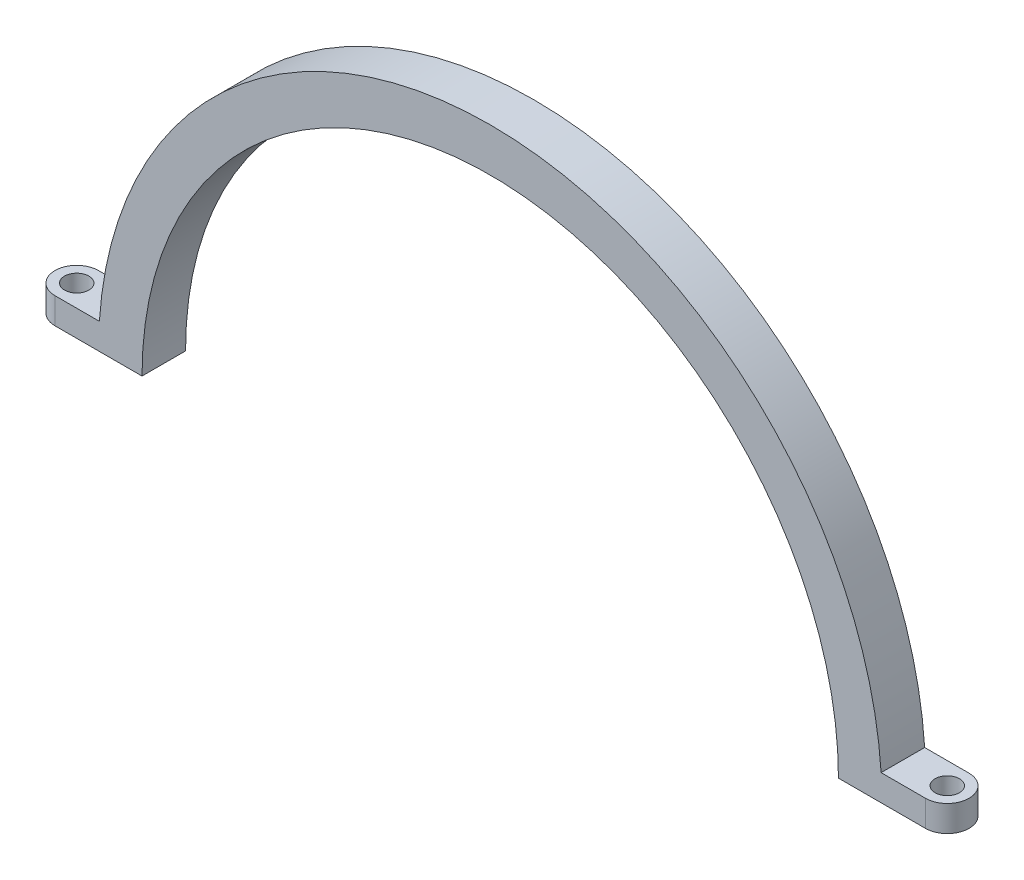
ISO-10303-21;
HEADER;
FILE_DESCRIPTION(('STEP AP214'),'2;1');
FILE_NAME('part.step','',(''),(''),'','','');
FILE_SCHEMA(('AUTOMOTIVE_DESIGN { 1 0 10303 214 1 1 1 1 }'));
ENDSEC;
DATA;
#1=APPLICATION_CONTEXT('core data for automotive mechanical design processes');
#2=APPLICATION_PROTOCOL_DEFINITION('international standard','automotive_design',2000,#1);
#3=PRODUCT_CONTEXT('',#1,'mechanical');
#4=PRODUCT('Part','Part','',(#3));
#5=PRODUCT_RELATED_PRODUCT_CATEGORY('part','',(#4));
#6=PRODUCT_DEFINITION_FORMATION('','',#4);
#7=PRODUCT_DEFINITION_CONTEXT('part definition',#1,'design');
#8=PRODUCT_DEFINITION('design','',#6,#7);
#9=PRODUCT_DEFINITION_SHAPE('','',#8);
#10=(LENGTH_UNIT() NAMED_UNIT(*) SI_UNIT(.MILLI.,.METRE.));
#11=(NAMED_UNIT(*) PLANE_ANGLE_UNIT() SI_UNIT($,.RADIAN.));
#12=(NAMED_UNIT(*) SI_UNIT($,.STERADIAN.) SOLID_ANGLE_UNIT());
#13=UNCERTAINTY_MEASURE_WITH_UNIT(LENGTH_MEASURE(1.E-05),#10,'distance_accuracy_value','');
#14=(GEOMETRIC_REPRESENTATION_CONTEXT(3) GLOBAL_UNCERTAINTY_ASSIGNED_CONTEXT((#13)) GLOBAL_UNIT_ASSIGNED_CONTEXT((#10,
#11,#12)) REPRESENTATION_CONTEXT('',''));
#15=CARTESIAN_POINT('',(0.,0.,0.));
#16=DIRECTION('',(0.,0.,1.));
#17=DIRECTION('',(1.,0.,0.));
#18=AXIS2_PLACEMENT_3D('',#15,#16,#17);
#19=CARTESIAN_POINT('',(0.,0.,5.));
#20=DIRECTION('',(0.,0.,-1.));
#21=DIRECTION('',(-1.,0.,0.));
#22=AXIS2_PLACEMENT_3D('',#19,#20,#21);
#23=CYLINDRICAL_SURFACE('',#22,45.);
#24=CARTESIAN_POINT('',(0.,0.,5.));
#25=DIRECTION('',(0.,0.,1.));
#26=DIRECTION('',(1.,0.,0.));
#27=AXIS2_PLACEMENT_3D('',#24,#25,#26);
#28=CIRCLE('',#27,45.);
#29=CARTESIAN_POINT('',(44.8998886412873,3.,5.));
#30=VERTEX_POINT('',#29);
#31=CARTESIAN_POINT('',(-44.8998886412873,3.,5.));
#32=VERTEX_POINT('',#31);
#33=EDGE_CURVE('E54',#30,#32,#28,.T.);
#34=ORIENTED_EDGE('',*,*,#33,.F.);
#35=DIRECTION('',(0.,0.,-1.));
#36=VECTOR('',#35,1.);
#37=CARTESIAN_POINT('',(44.8998886412873,3.,5.));
#38=LINE('',#37,#36);
#39=CARTESIAN_POINT('',(44.8998886412873,3.,0.));
#40=VERTEX_POINT('',#39);
#41=EDGE_CURVE('E58',#30,#40,#38,.T.);
#42=ORIENTED_EDGE('',*,*,#41,.T.);
#43=CARTESIAN_POINT('',(0.,0.,0.));
#44=DIRECTION('',(0.,0.,1.));
#45=DIRECTION('',(1.,0.,0.));
#46=AXIS2_PLACEMENT_3D('',#43,#44,#45);
#47=CIRCLE('',#46,45.);
#48=CARTESIAN_POINT('',(-44.8998886412873,3.,0.));
#49=VERTEX_POINT('',#48);
#50=EDGE_CURVE('E111',#40,#49,#47,.T.);
#51=ORIENTED_EDGE('',*,*,#50,.T.);
#52=DIRECTION('',(0.,0.,-1.));
#53=VECTOR('',#52,1.);
#54=CARTESIAN_POINT('',(-44.8998886412873,3.,5.));
#55=LINE('',#54,#53);
#56=EDGE_CURVE('E163',#32,#49,#55,.T.);
#57=ORIENTED_EDGE('',*,*,#56,.F.);
#58=EDGE_LOOP('',(#34,#42,#51,#57));
#59=FACE_BOUND('',#58,.T.);
#60=ADVANCED_FACE('F39',(#59),#23,.T.);
#61=CARTESIAN_POINT('',(0.,0.,5.));
#62=DIRECTION('',(0.,0.,-1.));
#63=DIRECTION('',(-1.,0.,0.));
#64=AXIS2_PLACEMENT_3D('',#61,#62,#63);
#65=CYLINDRICAL_SURFACE('',#64,40.);
#66=CARTESIAN_POINT('',(0.,0.,0.));
#67=DIRECTION('',(0.,0.,-1.));
#68=DIRECTION('',(1.,0.,0.));
#69=AXIS2_PLACEMENT_3D('',#66,#67,#68);
#70=CIRCLE('',#69,40.);
#71=CARTESIAN_POINT('',(-40.,0.,0.));
#72=VERTEX_POINT('',#71);
#73=CARTESIAN_POINT('',(40.,0.,0.));
#74=VERTEX_POINT('',#73);
#75=EDGE_CURVE('E112',#72,#74,#70,.T.);
#76=ORIENTED_EDGE('',*,*,#75,.T.);
#77=DIRECTION('',(0.,0.,-1.));
#78=VECTOR('',#77,1.);
#79=CARTESIAN_POINT('',(40.,0.,5.));
#80=LINE('',#79,#78);
#81=CARTESIAN_POINT('',(40.,0.,5.));
#82=VERTEX_POINT('',#81);
#83=EDGE_CURVE('E11',#82,#74,#80,.T.);
#84=ORIENTED_EDGE('',*,*,#83,.F.);
#85=CARTESIAN_POINT('',(0.,0.,5.));
#86=DIRECTION('',(0.,0.,-1.));
#87=DIRECTION('',(1.,0.,0.));
#88=AXIS2_PLACEMENT_3D('',#85,#86,#87);
#89=CIRCLE('',#88,40.);
#90=CARTESIAN_POINT('',(-40.,0.,5.));
#91=VERTEX_POINT('',#90);
#92=EDGE_CURVE('E168',#91,#82,#89,.T.);
#93=ORIENTED_EDGE('',*,*,#92,.F.);
#94=DIRECTION('',(0.,0.,-1.));
#95=VECTOR('',#94,1.);
#96=CARTESIAN_POINT('',(-40.,0.,5.));
#97=LINE('',#96,#95);
#98=EDGE_CURVE('E47',#91,#72,#97,.T.);
#99=ORIENTED_EDGE('',*,*,#98,.T.);
#100=EDGE_LOOP('',(#76,#84,#93,#99));
#101=FACE_BOUND('',#100,.T.);
#102=ADVANCED_FACE('F41',(#101),#65,.F.);
#103=CARTESIAN_POINT('',(40.,0.,5.));
#104=DIRECTION('',(0.,1.,0.));
#105=DIRECTION('',(0.,0.,1.));
#106=AXIS2_PLACEMENT_3D('',#103,#104,#105);
#107=PLANE('',#106);
#108=DIRECTION('',(1.,0.,0.));
#109=VECTOR('',#108,1.);
#110=CARTESIAN_POINT('',(40.,0.,0.));
#111=LINE('',#110,#109);
#112=CARTESIAN_POINT('',(50.,0.,4.44608520944706E-13));
#113=VERTEX_POINT('',#112);
#114=EDGE_CURVE('E101',#74,#113,#111,.T.);
#115=ORIENTED_EDGE('',*,*,#114,.T.);
#116=CARTESIAN_POINT('',(50.,0.,2.50000000000044));
#117=DIRECTION('',(0.,-1.,0.));
#118=DIRECTION('',(0.,0.,1.));
#119=AXIS2_PLACEMENT_3D('',#116,#117,#118);
#120=CIRCLE('',#119,2.5);
#121=CARTESIAN_POINT('',(50.,0.,5.00000000000044));
#122=VERTEX_POINT('',#121);
#123=EDGE_CURVE('E106',#113,#122,#120,.T.);
#124=ORIENTED_EDGE('',*,*,#123,.T.);
#125=DIRECTION('',(1.,0.,0.));
#126=VECTOR('',#125,1.);
#127=CARTESIAN_POINT('',(40.,0.,5.));
#128=LINE('',#127,#126);
#129=EDGE_CURVE('E171',#82,#122,#128,.T.);
#130=ORIENTED_EDGE('',*,*,#129,.F.);
#131=ORIENTED_EDGE('',*,*,#83,.T.);
#132=EDGE_LOOP('',(#115,#124,#130,#131));
#133=FACE_BOUND('',#132,.T.);
#134=CARTESIAN_POINT('',(50.,0.,2.50000000000044));
#135=DIRECTION('',(0.,-1.,0.));
#136=DIRECTION('',(0.,0.,-1.));
#137=AXIS2_PLACEMENT_3D('',#134,#135,#136);
#138=CIRCLE('',#137,1.4);
#139=CARTESIAN_POINT('',(50.,0.,1.10000000000045));
#140=VERTEX_POINT('',#139);
#141=EDGE_CURVE('E130',#140,#140,#138,.T.);
#142=ORIENTED_EDGE('',*,*,#141,.F.);
#143=EDGE_LOOP('',(#142));
#144=FACE_BOUND('',#143,.T.);
#145=ADVANCED_FACE('F103',(#133,#144),#107,.F.);
#146=CARTESIAN_POINT('',(-45.,0.,5.));
#147=DIRECTION('',(0.,1.,0.));
#148=DIRECTION('',(0.,0.,1.));
#149=AXIS2_PLACEMENT_3D('',#146,#147,#148);
#150=PLANE('',#149);
#151=ORIENTED_EDGE('',*,*,#98,.F.);
#152=DIRECTION('',(1.,0.,0.));
#153=VECTOR('',#152,1.);
#154=CARTESIAN_POINT('',(-45.,0.,5.));
#155=LINE('',#154,#153);
#156=CARTESIAN_POINT('',(-50.,0.,5.));
#157=VERTEX_POINT('',#156);
#158=EDGE_CURVE('E175',#157,#91,#155,.T.);
#159=ORIENTED_EDGE('',*,*,#158,.F.);
#160=CARTESIAN_POINT('',(-50.,0.,2.5));
#161=DIRECTION('',(0.,-1.,0.));
#162=DIRECTION('',(0.,0.,-1.));
#163=AXIS2_PLACEMENT_3D('',#160,#161,#162);
#164=CIRCLE('',#163,2.5);
#165=CARTESIAN_POINT('',(-50.,0.,0.));
#166=VERTEX_POINT('',#165);
#167=EDGE_CURVE('E146',#157,#166,#164,.T.);
#168=ORIENTED_EDGE('',*,*,#167,.T.);
#169=DIRECTION('',(1.,0.,0.));
#170=VECTOR('',#169,1.);
#171=CARTESIAN_POINT('',(-45.,0.,0.));
#172=LINE('',#171,#170);
#173=EDGE_CURVE('E172',#166,#72,#172,.T.);
#174=ORIENTED_EDGE('',*,*,#173,.T.);
#175=EDGE_LOOP('',(#151,#159,#168,#174));
#176=FACE_BOUND('',#175,.T.);
#177=CARTESIAN_POINT('',(-50.,0.,2.5));
#178=DIRECTION('',(0.,-1.,0.));
#179=DIRECTION('',(0.,0.,-1.));
#180=AXIS2_PLACEMENT_3D('',#177,#178,#179);
#181=CIRCLE('',#180,1.4);
#182=CARTESIAN_POINT('',(-50.,0.,1.1));
#183=VERTEX_POINT('',#182);
#184=EDGE_CURVE('E142',#183,#183,#181,.T.);
#185=ORIENTED_EDGE('',*,*,#184,.F.);
#186=EDGE_LOOP('',(#185));
#187=FACE_BOUND('',#186,.T.);
#188=ADVANCED_FACE('F190',(#176,#187),#150,.F.);
#189=CARTESIAN_POINT('',(0.,0.,5.));
#190=DIRECTION('',(0.,0.,1.));
#191=DIRECTION('',(1.,0.,0.));
#192=AXIS2_PLACEMENT_3D('',#189,#190,#191);
#193=PLANE('',#192);
#194=ORIENTED_EDGE('',*,*,#129,.T.);
#195=DIRECTION('',(0.,-1.,0.));
#196=VECTOR('',#195,1.);
#197=CARTESIAN_POINT('',(50.,3.,5.00000000000044));
#198=LINE('',#197,#196);
#199=CARTESIAN_POINT('',(50.,3.,5.00000000000044));
#200=VERTEX_POINT('',#199);
#201=EDGE_CURVE('E122',#200,#122,#198,.T.);
#202=ORIENTED_EDGE('',*,*,#201,.F.);
#203=DIRECTION('',(-1.,0.,0.));
#204=VECTOR('',#203,1.);
#205=CARTESIAN_POINT('',(45.,3.,5.00000000000044));
#206=LINE('',#205,#204);
#207=EDGE_CURVE('E132',#200,#30,#206,.T.);
#208=ORIENTED_EDGE('',*,*,#207,.T.);
#209=ORIENTED_EDGE('',*,*,#33,.T.);
#210=DIRECTION('',(-1.,0.,0.));
#211=VECTOR('',#210,1.);
#212=CARTESIAN_POINT('',(-45.,3.,5.));
#213=LINE('',#212,#211);
#214=CARTESIAN_POINT('',(-50.,3.,5.));
#215=VERTEX_POINT('',#214);
#216=EDGE_CURVE('E149',#32,#215,#213,.T.);
#217=ORIENTED_EDGE('',*,*,#216,.T.);
#218=DIRECTION('',(0.,-1.,0.));
#219=VECTOR('',#218,1.);
#220=CARTESIAN_POINT('',(-50.,3.,5.));
#221=LINE('',#220,#219);
#222=EDGE_CURVE('E157',#215,#157,#221,.T.);
#223=ORIENTED_EDGE('',*,*,#222,.T.);
#224=ORIENTED_EDGE('',*,*,#158,.T.);
#225=ORIENTED_EDGE('',*,*,#92,.T.);
#226=EDGE_LOOP('',(#194,#202,#208,#209,#217,#223,#224,#225));
#227=FACE_BOUND('',#226,.T.);
#228=ADVANCED_FACE('F193',(#227),#193,.T.);
#229=CARTESIAN_POINT('',(0.,0.,0.));
#230=DIRECTION('',(0.,0.,1.));
#231=DIRECTION('',(1.,0.,0.));
#232=AXIS2_PLACEMENT_3D('',#229,#230,#231);
#233=PLANE('',#232);
#234=DIRECTION('',(0.,-1.,0.));
#235=VECTOR('',#234,1.);
#236=CARTESIAN_POINT('',(50.,3.,4.44608520944706E-13));
#237=LINE('',#236,#235);
#238=CARTESIAN_POINT('',(50.,3.,4.44608520944706E-13));
#239=VERTEX_POINT('',#238);
#240=EDGE_CURVE('E115',#239,#113,#237,.T.);
#241=ORIENTED_EDGE('',*,*,#240,.T.);
#242=ORIENTED_EDGE('',*,*,#114,.F.);
#243=ORIENTED_EDGE('',*,*,#75,.F.);
#244=ORIENTED_EDGE('',*,*,#173,.F.);
#245=DIRECTION('',(0.,-1.,0.));
#246=VECTOR('',#245,1.);
#247=CARTESIAN_POINT('',(-50.,3.,0.));
#248=LINE('',#247,#246);
#249=CARTESIAN_POINT('',(-50.,3.,0.));
#250=VERTEX_POINT('',#249);
#251=EDGE_CURVE('E160',#250,#166,#248,.T.);
#252=ORIENTED_EDGE('',*,*,#251,.F.);
#253=DIRECTION('',(1.,0.,0.));
#254=VECTOR('',#253,1.);
#255=CARTESIAN_POINT('',(-45.,3.,0.));
#256=LINE('',#255,#254);
#257=EDGE_CURVE('E154',#250,#49,#256,.T.);
#258=ORIENTED_EDGE('',*,*,#257,.T.);
#259=ORIENTED_EDGE('',*,*,#50,.F.);
#260=DIRECTION('',(1.,0.,0.));
#261=VECTOR('',#260,1.);
#262=CARTESIAN_POINT('',(45.,3.,4.44089209850063E-13));
#263=LINE('',#262,#261);
#264=EDGE_CURVE('E118',#40,#239,#263,.T.);
#265=ORIENTED_EDGE('',*,*,#264,.T.);
#266=EDGE_LOOP('',(#241,#242,#243,#244,#252,#258,#259,#265));
#267=FACE_BOUND('',#266,.T.);
#268=ADVANCED_FACE('F116',(#267),#233,.F.);
#269=CARTESIAN_POINT('',(-50.,3.,2.5));
#270=DIRECTION('',(0.,-1.,0.));
#271=DIRECTION('',(0.,0.,-1.));
#272=AXIS2_PLACEMENT_3D('',#269,#270,#271);
#273=PLANE('',#272);
#274=CARTESIAN_POINT('',(-50.,3.,2.5));
#275=DIRECTION('',(0.,-1.,0.));
#276=DIRECTION('',(0.,0.,-1.));
#277=AXIS2_PLACEMENT_3D('',#274,#275,#276);
#278=CIRCLE('',#277,1.4);
#279=CARTESIAN_POINT('',(-50.,3.,1.1));
#280=VERTEX_POINT('',#279);
#281=EDGE_CURVE('E143',#280,#280,#278,.T.);
#282=ORIENTED_EDGE('',*,*,#281,.T.);
#283=EDGE_LOOP('',(#282));
#284=FACE_BOUND('',#283,.T.);
#285=ORIENTED_EDGE('',*,*,#216,.F.);
#286=ORIENTED_EDGE('',*,*,#56,.T.);
#287=ORIENTED_EDGE('',*,*,#257,.F.);
#288=CARTESIAN_POINT('',(-50.,3.,2.5));
#289=DIRECTION('',(0.,-1.,0.));
#290=DIRECTION('',(0.,0.,-1.));
#291=AXIS2_PLACEMENT_3D('',#288,#289,#290);
#292=CIRCLE('',#291,2.5);
#293=EDGE_CURVE('E151',#215,#250,#292,.T.);
#294=ORIENTED_EDGE('',*,*,#293,.F.);
#295=EDGE_LOOP('',(#285,#286,#287,#294));
#296=FACE_BOUND('',#295,.T.);
#297=ADVANCED_FACE('F196',(#284,#296),#273,.F.);
#298=CARTESIAN_POINT('',(-50.,3.,2.5));
#299=DIRECTION('',(0.,-1.,0.));
#300=DIRECTION('',(0.,0.,-1.));
#301=AXIS2_PLACEMENT_3D('',#298,#299,#300);
#302=CYLINDRICAL_SURFACE('',#301,2.5);
#303=ORIENTED_EDGE('',*,*,#167,.F.);
#304=ORIENTED_EDGE('',*,*,#222,.F.);
#305=ORIENTED_EDGE('',*,*,#293,.T.);
#306=ORIENTED_EDGE('',*,*,#251,.T.);
#307=EDGE_LOOP('',(#303,#304,#305,#306));
#308=FACE_BOUND('',#307,.T.);
#309=ADVANCED_FACE('F187',(#308),#302,.T.);
#310=CARTESIAN_POINT('',(-50.,3.,2.5));
#311=DIRECTION('',(0.,-1.,0.));
#312=DIRECTION('',(0.,0.,-1.));
#313=AXIS2_PLACEMENT_3D('',#310,#311,#312);
#314=CYLINDRICAL_SURFACE('',#313,1.4);
#315=ORIENTED_EDGE('',*,*,#281,.F.);
#316=EDGE_LOOP('',(#315));
#317=FACE_BOUND('',#316,.T.);
#318=ORIENTED_EDGE('',*,*,#184,.T.);
#319=EDGE_LOOP('',(#318));
#320=FACE_BOUND('',#319,.T.);
#321=ADVANCED_FACE('F201',(#317,#320),#314,.F.);
#322=CARTESIAN_POINT('',(50.,3.,2.50000000000044));
#323=DIRECTION('',(0.,1.,0.));
#324=DIRECTION('',(0.,0.,1.));
#325=AXIS2_PLACEMENT_3D('',#322,#323,#324);
#326=PLANE('',#325);
#327=CARTESIAN_POINT('',(50.,3.,2.50000000000044));
#328=DIRECTION('',(0.,-1.,0.));
#329=DIRECTION('',(0.,0.,-1.));
#330=AXIS2_PLACEMENT_3D('',#327,#328,#329);
#331=CIRCLE('',#330,1.4);
#332=CARTESIAN_POINT('',(50.,3.,1.10000000000045));
#333=VERTEX_POINT('',#332);
#334=EDGE_CURVE('E126',#333,#333,#331,.T.);
#335=ORIENTED_EDGE('',*,*,#334,.T.);
#336=EDGE_LOOP('',(#335));
#337=FACE_BOUND('',#336,.T.);
#338=ORIENTED_EDGE('',*,*,#41,.F.);
#339=ORIENTED_EDGE('',*,*,#207,.F.);
#340=CARTESIAN_POINT('',(50.,3.,2.50000000000044));
#341=DIRECTION('',(0.,-1.,0.));
#342=DIRECTION('',(0.,0.,1.));
#343=AXIS2_PLACEMENT_3D('',#340,#341,#342);
#344=CIRCLE('',#343,2.5);
#345=EDGE_CURVE('E127',#239,#200,#344,.T.);
#346=ORIENTED_EDGE('',*,*,#345,.F.);
#347=ORIENTED_EDGE('',*,*,#264,.F.);
#348=EDGE_LOOP('',(#338,#339,#346,#347));
#349=FACE_BOUND('',#348,.T.);
#350=ADVANCED_FACE('F198',(#337,#349),#326,.T.);
#351=CARTESIAN_POINT('',(50.,3.,2.50000000000044));
#352=DIRECTION('',(0.,-1.,0.));
#353=DIRECTION('',(0.,0.,-1.));
#354=AXIS2_PLACEMENT_3D('',#351,#352,#353);
#355=CYLINDRICAL_SURFACE('',#354,2.5);
#356=ORIENTED_EDGE('',*,*,#123,.F.);
#357=ORIENTED_EDGE('',*,*,#240,.F.);
#358=ORIENTED_EDGE('',*,*,#345,.T.);
#359=ORIENTED_EDGE('',*,*,#201,.T.);
#360=EDGE_LOOP('',(#356,#357,#358,#359));
#361=FACE_BOUND('',#360,.T.);
#362=ADVANCED_FACE('F125',(#361),#355,.T.);
#363=CARTESIAN_POINT('',(50.,3.,2.50000000000044));
#364=DIRECTION('',(0.,-1.,0.));
#365=DIRECTION('',(0.,0.,-1.));
#366=AXIS2_PLACEMENT_3D('',#363,#364,#365);
#367=CYLINDRICAL_SURFACE('',#366,1.4);
#368=ORIENTED_EDGE('',*,*,#334,.F.);
#369=EDGE_LOOP('',(#368));
#370=FACE_BOUND('',#369,.T.);
#371=ORIENTED_EDGE('',*,*,#141,.T.);
#372=EDGE_LOOP('',(#371));
#373=FACE_BOUND('',#372,.T.);
#374=ADVANCED_FACE('F208',(#370,#373),#367,.F.);
#375=CLOSED_SHELL('',(#60,#102,#145,#188,#228,#268,#297,#309,#321,#350,#362,#374));
#376=MANIFOLD_SOLID_BREP('B2',#375);
#377=ADVANCED_BREP_SHAPE_REPRESENTATION('',(#18,#376),#14);
#378=SHAPE_DEFINITION_REPRESENTATION(#9,#377);
ENDSEC;
END-ISO-10303-21;
